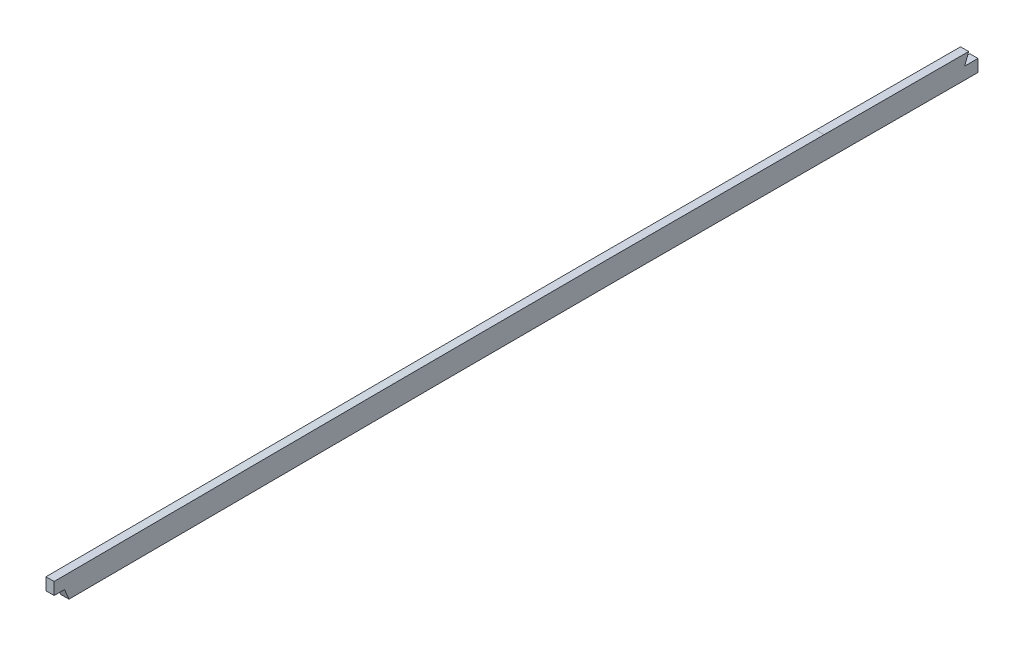
ISO-10303-21;
HEADER;
FILE_DESCRIPTION(('STEP AP214'),'2;1');
FILE_NAME('part.step','',(''),(''),'','','');
FILE_SCHEMA(('AUTOMOTIVE_DESIGN { 1 0 10303 214 1 1 1 1 }'));
ENDSEC;
DATA;
#1=APPLICATION_CONTEXT('core data for automotive mechanical design processes');
#2=APPLICATION_PROTOCOL_DEFINITION('international standard','automotive_design',2000,#1);
#3=PRODUCT_CONTEXT('',#1,'mechanical');
#4=PRODUCT('Part','Part','',(#3));
#5=PRODUCT_RELATED_PRODUCT_CATEGORY('part','',(#4));
#6=PRODUCT_DEFINITION_FORMATION('','',#4);
#7=PRODUCT_DEFINITION_CONTEXT('part definition',#1,'design');
#8=PRODUCT_DEFINITION('design','',#6,#7);
#9=PRODUCT_DEFINITION_SHAPE('','',#8);
#10=(LENGTH_UNIT() NAMED_UNIT(*) SI_UNIT(.MILLI.,.METRE.));
#11=(NAMED_UNIT(*) PLANE_ANGLE_UNIT() SI_UNIT($,.RADIAN.));
#12=(NAMED_UNIT(*) SI_UNIT($,.STERADIAN.) SOLID_ANGLE_UNIT());
#13=UNCERTAINTY_MEASURE_WITH_UNIT(LENGTH_MEASURE(1.E-05),#10,'distance_accuracy_value','');
#14=(GEOMETRIC_REPRESENTATION_CONTEXT(3) GLOBAL_UNCERTAINTY_ASSIGNED_CONTEXT((#13)) GLOBAL_UNIT_ASSIGNED_CONTEXT((#10,
#11,#12)) REPRESENTATION_CONTEXT('',''));
#15=CARTESIAN_POINT('',(0.,0.,0.));
#16=DIRECTION('',(0.,0.,1.));
#17=DIRECTION('',(1.,0.,0.));
#18=AXIS2_PLACEMENT_3D('',#15,#16,#17);
#19=CARTESIAN_POINT('',(-1.5875,130.384545774155,-1110.40497092626));
#20=CARTESIAN_POINT('',(-1.5875,130.370061323144,-1120.17083446494));
#21=CARTESIAN_POINT('',(-1.5875,130.338772026178,-1139.70305790845));
#22=CARTESIAN_POINT('',(-1.5875,130.277673039036,-1168.9983709745));
#23=CARTESIAN_POINT('',(-1.5875,130.194386875825,-1198.29061039493));
#24=CARTESIAN_POINT('',(-1.5875,130.113940835821,-1217.81419633032));
#25=CARTESIAN_POINT('',(-1.5875,130.065080520201,-1227.57650690267));
#26=B_SPLINE_CURVE_WITH_KNOTS('',3,(#19,#20,#21,#22,#23,#24,#25),.UNSPECIFIED.,.F.,.F.,(4,1,1,1,
4),(0.,0.25,0.5,0.75,1.),.UNSPECIFIED.);
#27=DIRECTION('',(1.,0.,0.));
#28=VECTOR('',#27,1.);
#29=SURFACE_OF_LINEAR_EXTRUSION('',#26,#28);
#30=DIRECTION('',(1.,0.,0.));
#31=VECTOR('',#30,1.);
#32=CARTESIAN_POINT('',(-1.5875,130.270526743321,-1170.38690422889));
#33=LINE('',#32,#31);
#34=CARTESIAN_POINT('',(1.5875,130.270526743297,-1170.38690422889));
#35=VERTEX_POINT('',#34);
#36=CARTESIAN_POINT('',(-1.5875,130.270526743297,-1170.38690422889));
#37=VERTEX_POINT('',#36);
#38=EDGE_CURVE('E198',#35,#37,#33,.F.);
#39=ORIENTED_EDGE('',*,*,#38,.F.);
#40=CARTESIAN_POINT('',(1.5875,130.384545774155,-1110.40497092626));
#41=CARTESIAN_POINT('',(1.5875,130.370061323144,-1120.17083446494));
#42=CARTESIAN_POINT('',(1.5875,130.338772026178,-1139.70305790845));
#43=CARTESIAN_POINT('',(1.5875,130.277673039036,-1168.9983709745));
#44=CARTESIAN_POINT('',(1.5875,130.194386875825,-1198.29061039493));
#45=CARTESIAN_POINT('',(1.5875,130.113940835821,-1217.81419633032));
#46=CARTESIAN_POINT('',(1.5875,130.065080520201,-1227.57650690267));
#47=B_SPLINE_CURVE_WITH_KNOTS('',3,(#40,#41,#42,#43,#44,#45,#46),.UNSPECIFIED.,.F.,.F.,(4,1,1,1,
4),(0.,0.25,0.5,0.75,1.),.UNSPECIFIED.);
#48=CARTESIAN_POINT('',(1.5875,130.38454577414,-1110.40497093677));
#49=VERTEX_POINT('',#48);
#50=EDGE_CURVE('E323',#49,#35,#47,.T.);
#51=ORIENTED_EDGE('',*,*,#50,.F.);
#52=DIRECTION('',(1.,0.,0.));
#53=VECTOR('',#52,1.);
#54=CARTESIAN_POINT('',(-1.5875,130.38454577414,-1110.40497093677));
#55=LINE('',#54,#53);
#56=CARTESIAN_POINT('',(-1.5875,130.38454577414,-1110.40497093677));
#57=VERTEX_POINT('',#56);
#58=EDGE_CURVE('E11',#57,#49,#55,.T.);
#59=ORIENTED_EDGE('',*,*,#58,.F.);
#60=EDGE_CURVE('E330',#57,#37,#26,.T.);
#61=ORIENTED_EDGE('',*,*,#60,.T.);
#62=EDGE_LOOP('',(#39,#51,#59,#61));
#63=FACE_BOUND('',#62,.T.);
#64=ADVANCED_FACE('F40',(#63),#29,.T.);
#65=CARTESIAN_POINT('',(-1.5875,129.578409662079,-768.73504864351));
#66=CARTESIAN_POINT('',(-1.5875,129.562145519502,-797.222409768422));
#67=CARTESIAN_POINT('',(-1.5875,129.725124502773,-854.203652026176));
#68=CARTESIAN_POINT('',(-1.5875,130.236578517582,-939.635195481091));
#69=CARTESIAN_POINT('',(-1.5875,130.524931921096,-1024.99295846428));
#70=CARTESIAN_POINT('',(-1.5875,130.426767717012,-1081.93761233553));
#71=CARTESIAN_POINT('',(-1.5875,130.38454577414,-1110.40497093677));
#72=B_SPLINE_CURVE_WITH_KNOTS('',3,(#65,#66,#67,#68,#69,#70,#71),.UNSPECIFIED.,.F.,.F.,(4,1,1,1,
4),(0.,0.25,0.5,0.75,1.),.UNSPECIFIED.);
#73=DIRECTION('',(1.,0.,0.));
#74=VECTOR('',#73,1.);
#75=SURFACE_OF_LINEAR_EXTRUSION('',#72,#74);
#76=DIRECTION('',(1.,0.,0.));
#77=VECTOR('',#76,1.);
#78=CARTESIAN_POINT('',(-6.0325,129.632745347889,-816.238424634587));
#79=LINE('',#78,#77);
#80=CARTESIAN_POINT('',(-1.5875,129.632745347889,-816.238424634587));
#81=VERTEX_POINT('',#80);
#82=CARTESIAN_POINT('',(1.5875,129.632745347889,-816.238424634587));
#83=VERTEX_POINT('',#82);
#84=EDGE_CURVE('E135',#81,#83,#79,.T.);
#85=ORIENTED_EDGE('',*,*,#84,.F.);
#86=EDGE_CURVE('E228',#81,#57,#72,.T.);
#87=ORIENTED_EDGE('',*,*,#86,.T.);
#88=ORIENTED_EDGE('',*,*,#58,.T.);
#89=CARTESIAN_POINT('',(1.5875,129.578409662079,-768.73504864351));
#90=CARTESIAN_POINT('',(1.5875,129.562145519502,-797.222409768422));
#91=CARTESIAN_POINT('',(1.5875,129.725124502773,-854.203652026176));
#92=CARTESIAN_POINT('',(1.5875,130.236578517582,-939.635195481091));
#93=CARTESIAN_POINT('',(1.5875,130.524931921096,-1024.99295846428));
#94=CARTESIAN_POINT('',(1.5875,130.426767717012,-1081.93761233553));
#95=CARTESIAN_POINT('',(1.5875,130.38454577414,-1110.40497093677));
#96=B_SPLINE_CURVE_WITH_KNOTS('',3,(#89,#90,#91,#92,#93,#94,#95),.UNSPECIFIED.,.F.,.F.,(4,1,1,1,
4),(0.,0.25,0.5,0.75,1.),.UNSPECIFIED.);
#97=EDGE_CURVE('E321',#83,#49,#96,.T.);
#98=ORIENTED_EDGE('',*,*,#97,.F.);
#99=EDGE_LOOP('',(#85,#87,#88,#98));
#100=FACE_BOUND('',#99,.T.);
#101=ADVANCED_FACE('F240',(#100),#75,.T.);
#102=CARTESIAN_POINT('',(-1.5875,138.468408213209,-768.740124164662));
#103=CARTESIAN_POINT('',(-1.5875,138.460280143351,-782.976796045164));
#104=CARTESIAN_POINT('',(-1.5875,138.479500079153,-797.213453801459));
#105=CARTESIAN_POINT('',(-1.5875,138.549690295794,-825.686695050945));
#106=CARTESIAN_POINT('',(-1.5875,138.600062665371,-839.923258915609));
#107=CARTESIAN_POINT('',(-1.5875,138.719026332735,-868.396318955595));
#108=CARTESIAN_POINT('',(-1.5875,138.78960797213,-882.632808961988));
#109=CARTESIAN_POINT('',(-1.5875,138.939594728624,-911.105746116677));
#110=CARTESIAN_POINT('',(-1.5875,139.018479562576,-925.342197006862));
#111=CARTESIAN_POINT('',(-1.5875,139.160090703363,-953.815172229786));
#112=CARTESIAN_POINT('',(-1.5875,139.222241505408,-968.051699178267));
#113=CARTESIAN_POINT('',(-1.5875,139.309954069578,-996.524919377054));
#114=CARTESIAN_POINT('',(-1.5875,139.335014039255,-1010.76160551679));
#115=CARTESIAN_POINT('',(-1.5875,139.349647551589,-1039.23491287134));
#116=CARTESIAN_POINT('',(-1.5875,139.340493535119,-1053.47156286932));
#117=CARTESIAN_POINT('',(-1.5875,139.313691901865,-1081.94486096797));
#118=CARTESIAN_POINT('',(-1.5875,139.295651369593,-1096.18150898086));
#119=CARTESIAN_POINT('',(-1.5875,139.27453599607,-1110.41815630688));
#120=B_SPLINE_CURVE_WITH_KNOTS('',3,(#102,#103,#104,#105,#106,#107,#108,#109,#110,#111,#112,
#113,#114,#115,#116,#117,#118,#119),.UNSPECIFIED.,.F.,.F.,(4,2,2,2,2,2,2,2,4),(0.,0.125,
0.250000000000001,0.375000000000001,0.500000000000002,0.625000000000002,0.750000000000003,
0.875000000000001,1.),.UNSPECIFIED.);
#121=DIRECTION('',(1.,0.,0.));
#122=VECTOR('',#121,1.);
#123=SURFACE_OF_LINEAR_EXTRUSION('',#120,#122);
#124=CARTESIAN_POINT('',(-1.5875,139.27453599607,-1110.41815630688));
#125=CARTESIAN_POINT('',(-1.5875,139.295651369593,-1096.18150898086));
#126=CARTESIAN_POINT('',(-1.5875,139.313691901865,-1081.94486096797));
#127=CARTESIAN_POINT('',(-1.5875,139.340493535119,-1053.47156286932));
#128=CARTESIAN_POINT('',(-1.5875,139.349647551589,-1039.23491287134));
#129=CARTESIAN_POINT('',(-1.5875,139.335014039255,-1010.76160551679));
#130=CARTESIAN_POINT('',(-1.5875,139.309954069578,-996.524919377054));
#131=CARTESIAN_POINT('',(-1.5875,139.222241505408,-968.051699178267));
#132=CARTESIAN_POINT('',(-1.5875,139.160090703363,-953.815172229786));
#133=CARTESIAN_POINT('',(-1.5875,139.018479562576,-925.342197006862));
#134=CARTESIAN_POINT('',(-1.5875,138.939594728624,-911.105746116677));
#135=CARTESIAN_POINT('',(-1.5875,138.78960797213,-882.632808961988));
#136=CARTESIAN_POINT('',(-1.5875,138.719026332735,-868.396318955595));
#137=CARTESIAN_POINT('',(-1.5875,138.600062665371,-839.923258915609));
#138=CARTESIAN_POINT('',(-1.5875,138.549690295794,-825.686695050945));
#139=CARTESIAN_POINT('',(-1.5875,138.513788231731,-811.12272616261));
#140=CARTESIAN_POINT('',(-1.5875,138.512989669133,-810.795377879388));
#141=CARTESIAN_POINT('',(-1.5875,138.512199639149,-810.468029576814));
#142=B_SPLINE_CURVE_WITH_KNOTS('',3,(#124,#125,#126,#127,#128,#129,#130,#131,#132,#133,#134,
#135,#136,#137,#138,#139,#140,#141),.UNSPECIFIED.,.F.,.F.,(4,2,2,2,2,2,2,2,4),
(0.122125825430947,0.247125825430945,0.372125825430944,0.497125825430944,0.622125825430945,
0.747125825430945,0.872125825430946,0.997125825430946,1.),.UNSPECIFIED.);
#143=CARTESIAN_POINT('',(-1.5875,138.512200810306,-810.468029573986));
#144=VERTEX_POINT('',#143);
#145=CARTESIAN_POINT('',(-1.5875,139.27453599607,-1110.41815630688));
#146=VERTEX_POINT('',#145);
#147=EDGE_CURVE('E270',#144,#146,#142,.F.);
#148=ORIENTED_EDGE('',*,*,#147,.F.);
#149=DIRECTION('',(1.,0.,0.));
#150=VECTOR('',#149,1.);
#151=CARTESIAN_POINT('',(-1.5875,138.512199639142,-810.468029573986));
#152=LINE('',#151,#150);
#153=CARTESIAN_POINT('',(1.5875,138.512200756992,-810.468029573986));
#154=VERTEX_POINT('',#153);
#155=EDGE_CURVE('E206',#144,#154,#152,.T.);
#156=ORIENTED_EDGE('',*,*,#155,.T.);
#157=CARTESIAN_POINT('',(1.5875,138.512199639149,-810.468029576684));
#158=CARTESIAN_POINT('',(1.5875,138.512989669132,-810.795377879301));
#159=CARTESIAN_POINT('',(1.5875,138.513788231731,-811.122726162567));
#160=CARTESIAN_POINT('',(1.5875,138.549690295794,-825.686695050945));
#161=CARTESIAN_POINT('',(1.5875,138.600062665371,-839.923258915609));
#162=CARTESIAN_POINT('',(1.5875,138.719026332735,-868.396318955595));
#163=CARTESIAN_POINT('',(1.5875,138.78960797213,-882.632808961988));
#164=CARTESIAN_POINT('',(1.5875,138.939594728624,-911.105746116677));
#165=CARTESIAN_POINT('',(1.5875,139.018479562576,-925.342197006862));
#166=CARTESIAN_POINT('',(1.5875,139.160090703363,-953.815172229786));
#167=CARTESIAN_POINT('',(1.5875,139.222241505408,-968.051699178267));
#168=CARTESIAN_POINT('',(1.5875,139.309954069578,-996.524919377054));
#169=CARTESIAN_POINT('',(1.5875,139.335014039255,-1010.76160551679));
#170=CARTESIAN_POINT('',(1.5875,139.349647551589,-1039.23491287134));
#171=CARTESIAN_POINT('',(1.5875,139.340493535119,-1053.47156286932));
#172=CARTESIAN_POINT('',(1.5875,139.313691901865,-1081.94486096797));
#173=CARTESIAN_POINT('',(1.5875,139.295651369593,-1096.18150898086));
#174=CARTESIAN_POINT('',(1.5875,139.27453599607,-1110.41815630688));
#175=B_SPLINE_CURVE_WITH_KNOTS('',3,(#157,#158,#159,#160,#161,#162,#163,#164,#165,#166,#167,
#168,#169,#170,#171,#172,#173,#174),.UNSPECIFIED.,.F.,.F.,(4,2,2,2,2,2,2,2,4),
(0.122125825430566,0.125,0.250000000000001,0.375000000000001,0.500000000000002,
0.625000000000002,0.750000000000003,0.875000000000001,1.),.UNSPECIFIED.);
#176=CARTESIAN_POINT('',(1.5875,139.27453599607,-1110.41815630688));
#177=VERTEX_POINT('',#176);
#178=EDGE_CURVE('E147',#154,#177,#175,.T.);
#179=ORIENTED_EDGE('',*,*,#178,.T.);
#180=DIRECTION('',(1.,0.,0.));
#181=VECTOR('',#180,1.);
#182=CARTESIAN_POINT('',(-1.5875,139.27453599607,-1110.41815630688));
#183=LINE('',#182,#181);
#184=EDGE_CURVE('E53',#146,#177,#183,.T.);
#185=ORIENTED_EDGE('',*,*,#184,.F.);
#186=EDGE_LOOP('',(#148,#156,#179,#185));
#187=FACE_BOUND('',#186,.T.);
#188=ADVANCED_FACE('F236',(#187),#123,.F.);
#189=CARTESIAN_POINT('',(-1.5875,139.27453599607,-1110.41815630688));
#190=CARTESIAN_POINT('',(-1.5875,139.245563914327,-1129.95202724936));
#191=CARTESIAN_POINT('',(-1.5875,139.211997476426,-1149.4858935041));
#192=CARTESIAN_POINT('',(-1.5875,139.115899086841,-1188.55355889258));
#193=CARTESIAN_POINT('',(-1.5875,139.052735015377,-1208.0873468335));
#194=CARTESIAN_POINT('',(-1.5875,138.954969175154,-1227.62100075096));
#195=B_SPLINE_CURVE_WITH_KNOTS('',3,(#189,#190,#191,#192,#193,#194),.UNSPECIFIED.,.F.,.F.,(4,2,
4),(0.,0.5,1.),.UNSPECIFIED.);
#196=DIRECTION('',(1.,0.,0.));
#197=VECTOR('',#196,1.);
#198=SURFACE_OF_LINEAR_EXTRUSION('',#195,#197);
#199=CARTESIAN_POINT('',(1.5875,139.27453599607,-1110.41815630688));
#200=CARTESIAN_POINT('',(1.5875,139.246676566375,-1129.20184292674));
#201=CARTESIAN_POINT('',(1.5875,139.214568890273,-1147.98552521202));
#202=CARTESIAN_POINT('',(1.5875,139.16942064509,-1166.76917749033));
#203=B_SPLINE_CURVE_WITH_KNOTS('',3,(#199,#200,#201,#202),.UNSPECIFIED.,.F.,.F.,(4,4),(0.,
0.480797858119833),.UNSPECIFIED.);
#204=CARTESIAN_POINT('',(1.5875,139.169416938462,-1166.76917748144));
#205=VERTEX_POINT('',#204);
#206=EDGE_CURVE('E212',#177,#205,#203,.T.);
#207=ORIENTED_EDGE('',*,*,#206,.T.);
#208=DIRECTION('',(1.,0.,0.));
#209=VECTOR('',#208,1.);
#210=CARTESIAN_POINT('',(-6.0325,139.169420645132,-1166.76917747251));
#211=LINE('',#210,#209);
#212=CARTESIAN_POINT('',(-1.5875,139.169420645132,-1166.76917747251));
#213=VERTEX_POINT('',#212);
#214=EDGE_CURVE('E69',#213,#205,#211,.T.);
#215=ORIENTED_EDGE('',*,*,#214,.F.);
#216=CARTESIAN_POINT('',(-1.5875,139.169420645089,-1166.76917749049));
#217=CARTESIAN_POINT('',(-1.5875,139.214568890272,-1147.98552521212));
#218=CARTESIAN_POINT('',(-1.5875,139.246676566375,-1129.2018429268));
#219=CARTESIAN_POINT('',(-1.5875,139.27453599607,-1110.41815630688));
#220=B_SPLINE_CURVE_WITH_KNOTS('',3,(#216,#217,#218,#219),.UNSPECIFIED.,.F.,.F.,(4,4),(0.,
0.480797858121194),.UNSPECIFIED.);
#221=EDGE_CURVE('E300',#146,#213,#220,.F.);
#222=ORIENTED_EDGE('',*,*,#221,.F.);
#223=ORIENTED_EDGE('',*,*,#184,.T.);
#224=EDGE_LOOP('',(#207,#215,#222,#223));
#225=FACE_BOUND('',#224,.T.);
#226=ADVANCED_FACE('F42',(#225),#198,.F.);
#227=CARTESIAN_POINT('',(-1.5875,0.,0.));
#228=DIRECTION('',(1.,0.,0.));
#229=DIRECTION('',(0.,0.,-1.));
#230=AXIS2_PLACEMENT_3D('',#227,#228,#229);
#231=PLANE('',#230);
#232=ORIENTED_EDGE('',*,*,#86,.F.);
#233=DIRECTION('',(0.,0.920878046769026,0.389850770140144));
#234=VECTOR('',#233,1.);
#235=CARTESIAN_POINT('',(-1.5875,312.735742776615,-738.722357427849));
#236=LINE('',#235,#234);
#237=CARTESIAN_POINT('',(-1.5875,133.759282778227,-814.491468236969));
#238=VERTEX_POINT('',#237);
#239=EDGE_CURVE('E208',#81,#238,#236,.T.);
#240=ORIENTED_EDGE('',*,*,#239,.T.);
#241=DIRECTION('',(0.,0.,1.));
#242=VECTOR('',#241,1.);
#243=CARTESIAN_POINT('',(-1.5875,133.759282778227,0.));
#244=LINE('',#243,#242);
#245=CARTESIAN_POINT('',(-1.5875,133.759282778227,-810.468029573986));
#246=VERTEX_POINT('',#245);
#247=EDGE_CURVE('E156',#238,#246,#244,.T.);
#248=ORIENTED_EDGE('',*,*,#247,.T.);
#249=DIRECTION('',(0.,1.,0.));
#250=VECTOR('',#249,1.);
#251=CARTESIAN_POINT('',(-1.5875,0.,-810.468029573986));
#252=LINE('',#251,#250);
#253=EDGE_CURVE('E131',#246,#144,#252,.T.);
#254=ORIENTED_EDGE('',*,*,#253,.T.);
#255=ORIENTED_EDGE('',*,*,#147,.T.);
#256=ORIENTED_EDGE('',*,*,#221,.T.);
#257=DIRECTION('',(0.,-0.934383280757223,0.35626939896849));
#258=VECTOR('',#257,1.);
#259=CARTESIAN_POINT('',(-1.5875,-370.74384302385,-972.345223497019));
#260=LINE('',#259,#258);
#261=CARTESIAN_POINT('',(-1.5875,135.018963115095,-1165.18665663751));
#262=VERTEX_POINT('',#261);
#263=EDGE_CURVE('E163',#213,#262,#260,.T.);
#264=ORIENTED_EDGE('',*,*,#263,.T.);
#265=DIRECTION('',(0.,0.,-1.));
#266=VECTOR('',#265,1.);
#267=CARTESIAN_POINT('',(-1.5875,135.018963115095,0.));
#268=LINE('',#267,#266);
#269=CARTESIAN_POINT('',(-1.5875,135.018963115095,-1170.38690422889));
#270=VERTEX_POINT('',#269);
#271=EDGE_CURVE('E189',#262,#270,#268,.T.);
#272=ORIENTED_EDGE('',*,*,#271,.T.);
#273=DIRECTION('',(0.,-1.,0.));
#274=VECTOR('',#273,1.);
#275=CARTESIAN_POINT('',(-1.5875,5.4729194499419E-11,-1170.3869042289));
#276=LINE('',#275,#274);
#277=EDGE_CURVE('E195',#270,#37,#276,.T.);
#278=ORIENTED_EDGE('',*,*,#277,.T.);
#279=ORIENTED_EDGE('',*,*,#60,.F.);
#280=EDGE_LOOP('',(#232,#240,#248,#254,#255,#256,#264,#272,#278,#279));
#281=FACE_BOUND('',#280,.T.);
#282=ADVANCED_FACE('F275',(#281),#231,.F.);
#283=CARTESIAN_POINT('',(1.5875,0.,0.));
#284=DIRECTION('',(1.,0.,0.));
#285=DIRECTION('',(0.,0.,-1.));
#286=AXIS2_PLACEMENT_3D('',#283,#284,#285);
#287=PLANE('',#286);
#288=DIRECTION('',(0.,0.920878046769026,0.389850770140144));
#289=VECTOR('',#288,1.);
#290=CARTESIAN_POINT('',(1.5875,133.759282778227,-814.491468236969));
#291=LINE('',#290,#289);
#292=CARTESIAN_POINT('',(1.5875,133.759282778227,-814.491468236969));
#293=VERTEX_POINT('',#292);
#294=EDGE_CURVE('E61',#83,#293,#291,.T.);
#295=ORIENTED_EDGE('',*,*,#294,.F.);
#296=ORIENTED_EDGE('',*,*,#97,.T.);
#297=ORIENTED_EDGE('',*,*,#50,.T.);
#298=DIRECTION('',(0.,-1.,0.));
#299=VECTOR('',#298,1.);
#300=CARTESIAN_POINT('',(1.5875,135.018963115095,-1170.38690422889));
#301=LINE('',#300,#299);
#302=CARTESIAN_POINT('',(1.5875,135.018963115095,-1170.38690422889));
#303=VERTEX_POINT('',#302);
#304=EDGE_CURVE('E169',#303,#35,#301,.T.);
#305=ORIENTED_EDGE('',*,*,#304,.F.);
#306=DIRECTION('',(0.,0.,-1.));
#307=VECTOR('',#306,1.);
#308=CARTESIAN_POINT('',(1.5875,135.018963115095,-1165.18665663751));
#309=LINE('',#308,#307);
#310=CARTESIAN_POINT('',(1.5875,135.018963115095,-1165.18665663751));
#311=VERTEX_POINT('',#310);
#312=EDGE_CURVE('E165',#311,#303,#309,.T.);
#313=ORIENTED_EDGE('',*,*,#312,.F.);
#314=DIRECTION('',(0.,-0.934383280757223,0.35626939896849));
#315=VECTOR('',#314,1.);
#316=CARTESIAN_POINT('',(1.5875,139.169420645132,-1166.76917747251));
#317=LINE('',#316,#315);
#318=EDGE_CURVE('E170',#205,#311,#317,.T.);
#319=ORIENTED_EDGE('',*,*,#318,.F.);
#320=ORIENTED_EDGE('',*,*,#206,.F.);
#321=ORIENTED_EDGE('',*,*,#178,.F.);
#322=DIRECTION('',(0.,1.,0.));
#323=VECTOR('',#322,1.);
#324=CARTESIAN_POINT('',(1.5875,138.512199639142,-810.468029573986));
#325=LINE('',#324,#323);
#326=CARTESIAN_POINT('',(1.5875,133.759282778227,-810.468029573986));
#327=VERTEX_POINT('',#326);
#328=EDGE_CURVE('E128',#327,#154,#325,.T.);
#329=ORIENTED_EDGE('',*,*,#328,.F.);
#330=DIRECTION('',(0.,0.,1.));
#331=VECTOR('',#330,1.);
#332=CARTESIAN_POINT('',(1.5875,133.759282778227,-810.468029573986));
#333=LINE('',#332,#331);
#334=EDGE_CURVE('E139',#293,#327,#333,.T.);
#335=ORIENTED_EDGE('',*,*,#334,.F.);
#336=EDGE_LOOP('',(#295,#296,#297,#305,#313,#319,#320,#321,#329,#335));
#337=FACE_BOUND('',#336,.T.);
#338=ADVANCED_FACE('F145',(#337),#287,.T.);
#339=CARTESIAN_POINT('',(-6.0325,135.018963115095,-1165.18665663751));
#340=DIRECTION('',(0.,-1.,0.));
#341=DIRECTION('',(0.,0.,-1.));
#342=AXIS2_PLACEMENT_3D('',#339,#340,#341);
#343=PLANE('',#342);
#344=DIRECTION('',(1.,0.,0.));
#345=VECTOR('',#344,1.);
#346=CARTESIAN_POINT('',(-6.0325,135.018963115095,-1165.18665663751));
#347=LINE('',#346,#345);
#348=EDGE_CURVE('E176',#262,#311,#347,.T.);
#349=ORIENTED_EDGE('',*,*,#348,.T.);
#350=ORIENTED_EDGE('',*,*,#312,.T.);
#351=DIRECTION('',(1.,0.,0.));
#352=VECTOR('',#351,1.);
#353=CARTESIAN_POINT('',(-6.0325,135.018963115095,-1170.38690422889));
#354=LINE('',#353,#352);
#355=EDGE_CURVE('E173',#270,#303,#354,.T.);
#356=ORIENTED_EDGE('',*,*,#355,.F.);
#357=ORIENTED_EDGE('',*,*,#271,.F.);
#358=EDGE_LOOP('',(#349,#350,#356,#357));
#359=FACE_BOUND('',#358,.T.);
#360=ADVANCED_FACE('F360',(#359),#343,.F.);
#361=CARTESIAN_POINT('',(-6.0325,139.169420645132,-1166.76917747251));
#362=DIRECTION('',(0.,0.35626939896849,0.934383280757223));
#363=DIRECTION('',(0.,-0.934383280757223,0.35626939896849));
#364=AXIS2_PLACEMENT_3D('',#361,#362,#363);
#365=PLANE('',#364);
#366=ORIENTED_EDGE('',*,*,#214,.T.);
#367=ORIENTED_EDGE('',*,*,#318,.T.);
#368=ORIENTED_EDGE('',*,*,#348,.F.);
#369=ORIENTED_EDGE('',*,*,#263,.F.);
#370=EDGE_LOOP('',(#366,#367,#368,#369));
#371=FACE_BOUND('',#370,.T.);
#372=ADVANCED_FACE('F284',(#371),#365,.F.);
#373=CARTESIAN_POINT('',(-6.0325,135.018963115095,-1170.38690422889));
#374=DIRECTION('',(0.,0.,1.));
#375=DIRECTION('',(0.,-1.,0.));
#376=AXIS2_PLACEMENT_3D('',#373,#374,#375);
#377=PLANE('',#376);
#378=ORIENTED_EDGE('',*,*,#38,.T.);
#379=ORIENTED_EDGE('',*,*,#277,.F.);
#380=ORIENTED_EDGE('',*,*,#355,.T.);
#381=ORIENTED_EDGE('',*,*,#304,.T.);
#382=EDGE_LOOP('',(#378,#379,#380,#381));
#383=FACE_BOUND('',#382,.T.);
#384=ADVANCED_FACE('F357',(#383),#377,.F.);
#385=CARTESIAN_POINT('',(-6.0325,133.759282778227,-814.491468236969));
#386=DIRECTION('',(0.,0.389850770140144,-0.920878046769026));
#387=DIRECTION('',(0.,0.920878046769026,0.389850770140144));
#388=AXIS2_PLACEMENT_3D('',#385,#386,#387);
#389=PLANE('',#388);
#390=ORIENTED_EDGE('',*,*,#84,.T.);
#391=ORIENTED_EDGE('',*,*,#294,.T.);
#392=DIRECTION('',(1.,0.,0.));
#393=VECTOR('',#392,1.);
#394=CARTESIAN_POINT('',(-6.0325,133.759282778227,-814.491468236969));
#395=LINE('',#394,#393);
#396=EDGE_CURVE('E136',#238,#293,#395,.T.);
#397=ORIENTED_EDGE('',*,*,#396,.F.);
#398=ORIENTED_EDGE('',*,*,#239,.F.);
#399=EDGE_LOOP('',(#390,#391,#397,#398));
#400=FACE_BOUND('',#399,.T.);
#401=ADVANCED_FACE('F369',(#400),#389,.F.);
#402=CARTESIAN_POINT('',(-6.0325,138.512199639142,-810.468029573986));
#403=DIRECTION('',(0.,0.,-1.));
#404=DIRECTION('',(-1.,0.,0.));
#405=AXIS2_PLACEMENT_3D('',#402,#403,#404);
#406=PLANE('',#405);
#407=ORIENTED_EDGE('',*,*,#253,.F.);
#408=DIRECTION('',(1.,0.,0.));
#409=VECTOR('',#408,1.);
#410=CARTESIAN_POINT('',(-6.0325,133.759282778227,-810.468029573986));
#411=LINE('',#410,#409);
#412=EDGE_CURVE('E124',#246,#327,#411,.T.);
#413=ORIENTED_EDGE('',*,*,#412,.T.);
#414=ORIENTED_EDGE('',*,*,#328,.T.);
#415=ORIENTED_EDGE('',*,*,#155,.F.);
#416=EDGE_LOOP('',(#407,#413,#414,#415));
#417=FACE_BOUND('',#416,.T.);
#418=ADVANCED_FACE('F126',(#417),#406,.F.);
#419=CARTESIAN_POINT('',(-6.0325,133.759282778227,-810.468029573986));
#420=DIRECTION('',(0.,1.,0.));
#421=DIRECTION('',(0.,0.,1.));
#422=AXIS2_PLACEMENT_3D('',#419,#420,#421);
#423=PLANE('',#422);
#424=ORIENTED_EDGE('',*,*,#396,.T.);
#425=ORIENTED_EDGE('',*,*,#334,.T.);
#426=ORIENTED_EDGE('',*,*,#412,.F.);
#427=ORIENTED_EDGE('',*,*,#247,.F.);
#428=EDGE_LOOP('',(#424,#425,#426,#427));
#429=FACE_BOUND('',#428,.T.);
#430=ADVANCED_FACE('F140',(#429),#423,.F.);
#431=CLOSED_SHELL('',(#64,#101,#188,#226,#282,#338,#360,#372,#384,#401,#418,#430));
#432=MANIFOLD_SOLID_BREP('B2',#431);
#433=ADVANCED_BREP_SHAPE_REPRESENTATION('',(#18,#432),#14);
#434=SHAPE_DEFINITION_REPRESENTATION(#9,#433);
ENDSEC;
END-ISO-10303-21;
